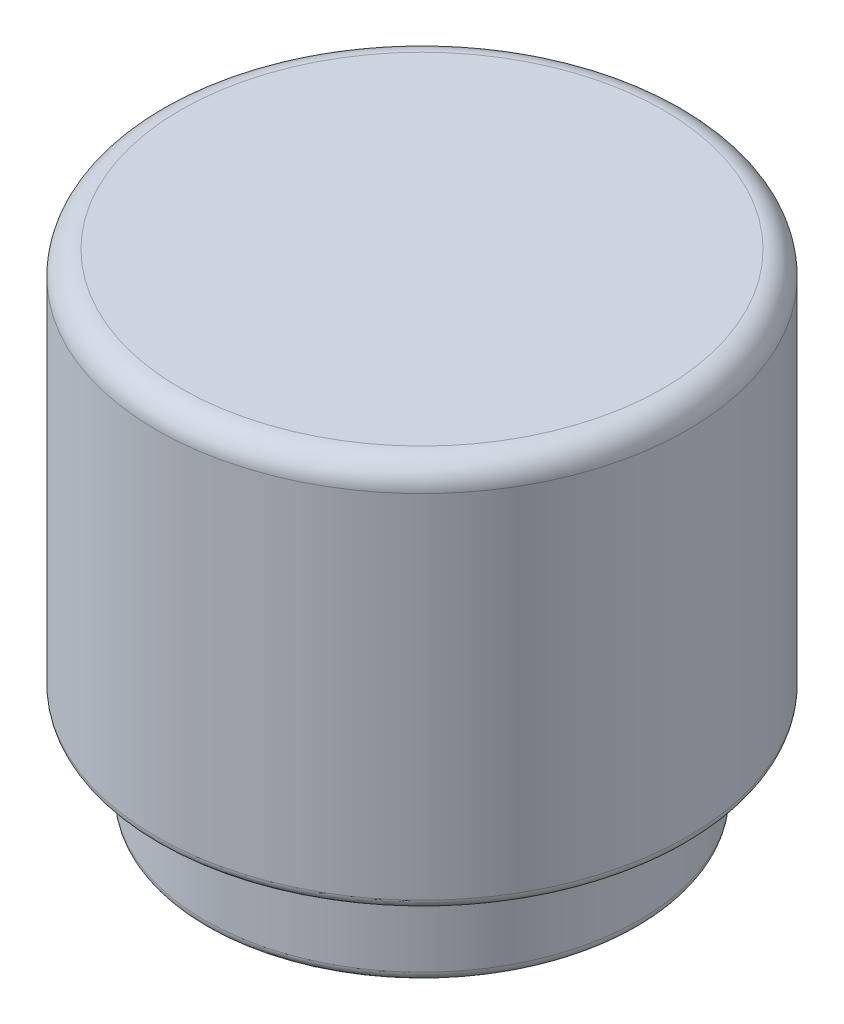
ISO-10303-21;
HEADER;
FILE_DESCRIPTION(('STEP AP214'),'2;1');
FILE_NAME('part.step','',(''),(''),'','','');
FILE_SCHEMA(('AUTOMOTIVE_DESIGN { 1 0 10303 214 1 1 1 1 }'));
ENDSEC;
DATA;
#1=APPLICATION_CONTEXT('core data for automotive mechanical design processes');
#2=APPLICATION_PROTOCOL_DEFINITION('international standard','automotive_design',2000,#1);
#3=PRODUCT_CONTEXT('',#1,'mechanical');
#4=PRODUCT('Part','Part','',(#3));
#5=PRODUCT_RELATED_PRODUCT_CATEGORY('part','',(#4));
#6=PRODUCT_DEFINITION_FORMATION('','',#4);
#7=PRODUCT_DEFINITION_CONTEXT('part definition',#1,'design');
#8=PRODUCT_DEFINITION('design','',#6,#7);
#9=PRODUCT_DEFINITION_SHAPE('','',#8);
#10=(LENGTH_UNIT() NAMED_UNIT(*) SI_UNIT(.MILLI.,.METRE.));
#11=(NAMED_UNIT(*) PLANE_ANGLE_UNIT() SI_UNIT($,.RADIAN.));
#12=(NAMED_UNIT(*) SI_UNIT($,.STERADIAN.) SOLID_ANGLE_UNIT());
#13=UNCERTAINTY_MEASURE_WITH_UNIT(LENGTH_MEASURE(1.E-05),#10,'distance_accuracy_value','');
#14=(GEOMETRIC_REPRESENTATION_CONTEXT(3) GLOBAL_UNCERTAINTY_ASSIGNED_CONTEXT((#13)) GLOBAL_UNIT_ASSIGNED_CONTEXT((#10,
#11,#12)) REPRESENTATION_CONTEXT('',''));
#15=CARTESIAN_POINT('',(0.,0.,0.));
#16=DIRECTION('',(0.,0.,1.));
#17=DIRECTION('',(1.,0.,0.));
#18=AXIS2_PLACEMENT_3D('',#15,#16,#17);
#19=CARTESIAN_POINT('',(0.,-0.5,0.));
#20=DIRECTION('',(0.,-1.,0.));
#21=DIRECTION('',(0.,0.,-1.));
#22=AXIS2_PLACEMENT_3D('',#19,#20,#21);
#23=PLANE('',#22);
#24=CARTESIAN_POINT('',(0.,-0.5,0.));
#25=DIRECTION('',(0.,-1.,0.));
#26=DIRECTION('',(0.,0.,-1.));
#27=AXIS2_PLACEMENT_3D('',#24,#25,#26);
#28=CIRCLE('',#27,4.8);
#29=CARTESIAN_POINT('',(0.,-0.499999999999999,-4.8));
#30=VERTEX_POINT('',#29);
#31=EDGE_CURVE('E66',#30,#30,#28,.T.);
#32=ORIENTED_EDGE('',*,*,#31,.T.);
#33=EDGE_LOOP('',(#32));
#34=FACE_BOUND('',#33,.T.);
#35=ADVANCED_FACE('F34',(#34),#23,.T.);
#36=CARTESIAN_POINT('',(0.,0.,0.));
#37=DIRECTION('',(0.,1.,0.));
#38=DIRECTION('',(0.,0.,1.));
#39=AXIS2_PLACEMENT_3D('',#36,#37,#38);
#40=CYLINDRICAL_SURFACE('',#39,5.);
#41=CARTESIAN_POINT('',(0.,-0.7,0.));
#42=DIRECTION('',(0.,-1.,0.));
#43=DIRECTION('',(0.,0.,-1.));
#44=AXIS2_PLACEMENT_3D('',#41,#42,#43);
#45=CIRCLE('',#44,5.);
#46=CARTESIAN_POINT('',(0.,-0.699999999999999,-5.));
#47=VERTEX_POINT('',#46);
#48=EDGE_CURVE('E69',#47,#47,#45,.F.);
#49=ORIENTED_EDGE('',*,*,#48,.T.);
#50=EDGE_LOOP('',(#49));
#51=FACE_BOUND('',#50,.T.);
#52=CARTESIAN_POINT('',(0.,-7.5,0.));
#53=DIRECTION('',(0.,1.,0.));
#54=DIRECTION('',(0.,0.,1.));
#55=AXIS2_PLACEMENT_3D('',#52,#53,#54);
#56=CIRCLE('',#55,5.);
#57=CARTESIAN_POINT('',(0.,-7.5,5.));
#58=VERTEX_POINT('',#57);
#59=EDGE_CURVE('E78',#58,#58,#56,.T.);
#60=ORIENTED_EDGE('',*,*,#59,.F.);
#61=EDGE_LOOP('',(#60));
#62=FACE_BOUND('',#61,.T.);
#63=ADVANCED_FACE('F102',(#51,#62),#40,.F.);
#64=CARTESIAN_POINT('',(0.,-7.5,4.));
#65=DIRECTION('',(0.,1.,0.));
#66=DIRECTION('',(0.,0.,1.));
#67=AXIS2_PLACEMENT_3D('',#64,#65,#66);
#68=PLANE('',#67);
#69=CARTESIAN_POINT('',(0.,-7.5,0.));
#70=DIRECTION('',(0.,1.,0.));
#71=DIRECTION('',(0.,0.,1.));
#72=AXIS2_PLACEMENT_3D('',#69,#70,#71);
#73=CIRCLE('',#72,4.2);
#74=CARTESIAN_POINT('',(0.,-7.5,4.2));
#75=VERTEX_POINT('',#74);
#76=EDGE_CURVE('E57',#75,#75,#73,.F.);
#77=ORIENTED_EDGE('',*,*,#76,.T.);
#78=EDGE_LOOP('',(#77));
#79=FACE_BOUND('',#78,.T.);
#80=ORIENTED_EDGE('',*,*,#59,.T.);
#81=EDGE_LOOP('',(#80));
#82=FACE_BOUND('',#81,.T.);
#83=ADVANCED_FACE('F108',(#79,#82),#68,.T.);
#84=CARTESIAN_POINT('',(0.,0.,0.));
#85=DIRECTION('',(0.,1.,0.));
#86=DIRECTION('',(0.,0.,1.));
#87=AXIS2_PLACEMENT_3D('',#84,#85,#86);
#88=CYLINDRICAL_SURFACE('',#87,4.);
#89=CARTESIAN_POINT('',(0.,-7.7,0.));
#90=DIRECTION('',(0.,1.,0.));
#91=DIRECTION('',(0.,0.,1.));
#92=AXIS2_PLACEMENT_3D('',#89,#90,#91);
#93=CIRCLE('',#92,4.);
#94=CARTESIAN_POINT('',(0.,-7.7,4.));
#95=VERTEX_POINT('',#94);
#96=EDGE_CURVE('E60',#95,#95,#93,.T.);
#97=ORIENTED_EDGE('',*,*,#96,.T.);
#98=EDGE_LOOP('',(#97));
#99=FACE_BOUND('',#98,.T.);
#100=CARTESIAN_POINT('',(0.,-9.8,0.));
#101=DIRECTION('',(0.,-1.,0.));
#102=DIRECTION('',(0.,0.,-1.));
#103=AXIS2_PLACEMENT_3D('',#100,#101,#102);
#104=CIRCLE('',#103,4.);
#105=CARTESIAN_POINT('',(0.,-9.8,-4.));
#106=VERTEX_POINT('',#105);
#107=EDGE_CURVE('E63',#106,#106,#104,.T.);
#108=ORIENTED_EDGE('',*,*,#107,.T.);
#109=EDGE_LOOP('',(#108));
#110=FACE_BOUND('',#109,.T.);
#111=ADVANCED_FACE('F98',(#99,#110),#88,.F.);
#112=CARTESIAN_POINT('',(0.,-10.,4.));
#113=DIRECTION('',(0.,-1.,0.));
#114=DIRECTION('',(0.,0.,-1.));
#115=AXIS2_PLACEMENT_3D('',#112,#113,#114);
#116=PLANE('',#115);
#117=CARTESIAN_POINT('',(0.,-10.,0.));
#118=DIRECTION('',(0.,-1.,0.));
#119=DIRECTION('',(0.,0.,-1.));
#120=AXIS2_PLACEMENT_3D('',#117,#118,#119);
#121=CIRCLE('',#120,4.2);
#122=CARTESIAN_POINT('',(0.,-10.,-4.2));
#123=VERTEX_POINT('',#122);
#124=EDGE_CURVE('E49',#123,#123,#121,.F.);
#125=ORIENTED_EDGE('',*,*,#124,.T.);
#126=EDGE_LOOP('',(#125));
#127=FACE_BOUND('',#126,.T.);
#128=CARTESIAN_POINT('',(0.,-10.,0.));
#129=DIRECTION('',(0.,-1.,0.));
#130=DIRECTION('',(0.,0.,-1.));
#131=AXIS2_PLACEMENT_3D('',#128,#129,#130);
#132=CIRCLE('',#131,4.3);
#133=CARTESIAN_POINT('',(0.,-10.,-4.3));
#134=VERTEX_POINT('',#133);
#135=EDGE_CURVE('E54',#134,#134,#132,.T.);
#136=ORIENTED_EDGE('',*,*,#135,.T.);
#137=EDGE_LOOP('',(#136));
#138=FACE_BOUND('',#137,.T.);
#139=ADVANCED_FACE('F89',(#127,#138),#116,.T.);
#140=CARTESIAN_POINT('',(0.,0.,0.));
#141=DIRECTION('',(0.,1.,0.));
#142=DIRECTION('',(0.,0.,1.));
#143=AXIS2_PLACEMENT_3D('',#140,#141,#142);
#144=CYLINDRICAL_SURFACE('',#143,4.5);
#145=CARTESIAN_POINT('',(0.,-9.8,0.));
#146=DIRECTION('',(0.,-1.,0.));
#147=DIRECTION('',(0.,0.,-1.));
#148=AXIS2_PLACEMENT_3D('',#145,#146,#147);
#149=CIRCLE('',#148,4.5);
#150=CARTESIAN_POINT('',(0.,-9.8,-4.5));
#151=VERTEX_POINT('',#150);
#152=EDGE_CURVE('E45',#151,#151,#149,.F.);
#153=ORIENTED_EDGE('',*,*,#152,.T.);
#154=EDGE_LOOP('',(#153));
#155=FACE_BOUND('',#154,.T.);
#156=CARTESIAN_POINT('',(0.,-8.,0.));
#157=DIRECTION('',(0.,1.,0.));
#158=DIRECTION('',(0.,0.,1.));
#159=AXIS2_PLACEMENT_3D('',#156,#157,#158);
#160=CIRCLE('',#159,4.5);
#161=CARTESIAN_POINT('',(0.,-8.,4.5));
#162=VERTEX_POINT('',#161);
#163=EDGE_CURVE('E81',#162,#162,#160,.T.);
#164=ORIENTED_EDGE('',*,*,#163,.F.);
#165=EDGE_LOOP('',(#164));
#166=FACE_BOUND('',#165,.T.);
#167=ADVANCED_FACE('F87',(#155,#166),#144,.T.);
#168=CARTESIAN_POINT('',(0.,-8.,4.5));
#169=DIRECTION('',(0.,-1.,0.));
#170=DIRECTION('',(0.,0.,-1.));
#171=AXIS2_PLACEMENT_3D('',#168,#169,#170);
#172=PLANE('',#171);
#173=CARTESIAN_POINT('',(0.,-8.,0.));
#174=DIRECTION('',(0.,-1.,0.));
#175=DIRECTION('',(0.,0.,-1.));
#176=AXIS2_PLACEMENT_3D('',#173,#174,#175);
#177=CIRCLE('',#176,5.3);
#178=CARTESIAN_POINT('',(0.,-8.,-5.3));
#179=VERTEX_POINT('',#178);
#180=EDGE_CURVE('E10',#179,#179,#177,.T.);
#181=ORIENTED_EDGE('',*,*,#180,.T.);
#182=EDGE_LOOP('',(#181));
#183=FACE_BOUND('',#182,.T.);
#184=ORIENTED_EDGE('',*,*,#163,.T.);
#185=EDGE_LOOP('',(#184));
#186=FACE_BOUND('',#185,.T.);
#187=ADVANCED_FACE('F85',(#183,#186),#172,.T.);
#188=CARTESIAN_POINT('',(0.,0.,0.));
#189=DIRECTION('',(0.,1.,0.));
#190=DIRECTION('',(0.,0.,1.));
#191=AXIS2_PLACEMENT_3D('',#188,#189,#190);
#192=CYLINDRICAL_SURFACE('',#191,5.5);
#193=CARTESIAN_POINT('',(0.,-7.8,0.));
#194=DIRECTION('',(0.,-1.,0.));
#195=DIRECTION('',(0.,0.,-1.));
#196=AXIS2_PLACEMENT_3D('',#193,#194,#195);
#197=CIRCLE('',#196,5.5);
#198=CARTESIAN_POINT('',(0.,-7.8,-5.5));
#199=VERTEX_POINT('',#198);
#200=EDGE_CURVE('E41',#199,#199,#197,.F.);
#201=ORIENTED_EDGE('',*,*,#200,.T.);
#202=EDGE_LOOP('',(#201));
#203=FACE_BOUND('',#202,.T.);
#204=CARTESIAN_POINT('',(0.,-0.5,0.));
#205=DIRECTION('',(0.,1.,0.));
#206=DIRECTION('',(0.,0.,1.));
#207=AXIS2_PLACEMENT_3D('',#204,#205,#206);
#208=CIRCLE('',#207,5.5);
#209=CARTESIAN_POINT('',(0.,-0.500000000000001,5.5));
#210=VERTEX_POINT('',#209);
#211=EDGE_CURVE('E72',#210,#210,#208,.F.);
#212=ORIENTED_EDGE('',*,*,#211,.T.);
#213=EDGE_LOOP('',(#212));
#214=FACE_BOUND('',#213,.T.);
#215=ADVANCED_FACE('F96',(#203,#214),#192,.T.);
#216=CARTESIAN_POINT('',(0.,0.,0.));
#217=DIRECTION('',(0.,1.,0.));
#218=DIRECTION('',(0.,0.,1.));
#219=AXIS2_PLACEMENT_3D('',#216,#217,#218);
#220=PLANE('',#219);
#221=CARTESIAN_POINT('',(0.,0.,0.));
#222=DIRECTION('',(0.,1.,0.));
#223=DIRECTION('',(0.,0.,1.));
#224=AXIS2_PLACEMENT_3D('',#221,#222,#223);
#225=CIRCLE('',#224,5.);
#226=CARTESIAN_POINT('',(0.,0.,5.));
#227=VERTEX_POINT('',#226);
#228=EDGE_CURVE('E75',#227,#227,#225,.T.);
#229=ORIENTED_EDGE('',*,*,#228,.T.);
#230=EDGE_LOOP('',(#229));
#231=FACE_BOUND('',#230,.T.);
#232=ADVANCED_FACE('F117',(#231),#220,.T.);
#233=CARTESIAN_POINT('',(0.,-0.5,0.));
#234=DIRECTION('',(0.,1.,0.));
#235=DIRECTION('',(0.,0.,1.));
#236=AXIS2_PLACEMENT_3D('',#233,#234,#235);
#237=TOROIDAL_SURFACE('',#236,5.,0.5);
#238=ORIENTED_EDGE('',*,*,#211,.F.);
#239=EDGE_LOOP('',(#238));
#240=FACE_BOUND('',#239,.T.);
#241=ORIENTED_EDGE('',*,*,#228,.F.);
#242=EDGE_LOOP('',(#241));
#243=FACE_BOUND('',#242,.T.);
#244=ADVANCED_FACE('F113',(#240,#243),#237,.T.);
#245=CARTESIAN_POINT('',(0.,-0.7,0.));
#246=DIRECTION('',(0.,-1.,0.));
#247=DIRECTION('',(0.,0.,-1.));
#248=AXIS2_PLACEMENT_3D('',#245,#246,#247);
#249=TOROIDAL_SURFACE('',#248,4.8,0.2);
#250=ORIENTED_EDGE('',*,*,#31,.F.);
#251=EDGE_LOOP('',(#250));
#252=FACE_BOUND('',#251,.T.);
#253=ORIENTED_EDGE('',*,*,#48,.F.);
#254=EDGE_LOOP('',(#253));
#255=FACE_BOUND('',#254,.T.);
#256=ADVANCED_FACE('F116',(#252,#255),#249,.F.);
#257=CARTESIAN_POINT('',(0.,-7.7,0.));
#258=DIRECTION('',(0.,1.,0.));
#259=DIRECTION('',(0.,0.,1.));
#260=AXIS2_PLACEMENT_3D('',#257,#258,#259);
#261=TOROIDAL_SURFACE('',#260,4.2,0.2);
#262=ORIENTED_EDGE('',*,*,#76,.F.);
#263=EDGE_LOOP('',(#262));
#264=FACE_BOUND('',#263,.T.);
#265=ORIENTED_EDGE('',*,*,#96,.F.);
#266=EDGE_LOOP('',(#265));
#267=FACE_BOUND('',#266,.T.);
#268=ADVANCED_FACE('F121',(#264,#267),#261,.T.);
#269=CARTESIAN_POINT('',(0.,-9.8,0.));
#270=DIRECTION('',(0.,-1.,0.));
#271=DIRECTION('',(0.,0.,-1.));
#272=AXIS2_PLACEMENT_3D('',#269,#270,#271);
#273=TOROIDAL_SURFACE('',#272,4.2,0.2);
#274=ORIENTED_EDGE('',*,*,#107,.F.);
#275=EDGE_LOOP('',(#274));
#276=FACE_BOUND('',#275,.T.);
#277=ORIENTED_EDGE('',*,*,#124,.F.);
#278=EDGE_LOOP('',(#277));
#279=FACE_BOUND('',#278,.T.);
#280=ADVANCED_FACE('F125',(#276,#279),#273,.T.);
#281=CARTESIAN_POINT('',(0.,-9.8,0.));
#282=DIRECTION('',(0.,-1.,0.));
#283=DIRECTION('',(0.,0.,-1.));
#284=AXIS2_PLACEMENT_3D('',#281,#282,#283);
#285=TOROIDAL_SURFACE('',#284,4.3,0.2);
#286=ORIENTED_EDGE('',*,*,#135,.F.);
#287=EDGE_LOOP('',(#286));
#288=FACE_BOUND('',#287,.T.);
#289=ORIENTED_EDGE('',*,*,#152,.F.);
#290=EDGE_LOOP('',(#289));
#291=FACE_BOUND('',#290,.T.);
#292=ADVANCED_FACE('F128',(#288,#291),#285,.T.);
#293=CARTESIAN_POINT('',(0.,-7.8,0.));
#294=DIRECTION('',(0.,-1.,0.));
#295=DIRECTION('',(0.,0.,-1.));
#296=AXIS2_PLACEMENT_3D('',#293,#294,#295);
#297=TOROIDAL_SURFACE('',#296,5.3,0.2);
#298=ORIENTED_EDGE('',*,*,#180,.F.);
#299=EDGE_LOOP('',(#298));
#300=FACE_BOUND('',#299,.T.);
#301=ORIENTED_EDGE('',*,*,#200,.F.);
#302=EDGE_LOOP('',(#301));
#303=FACE_BOUND('',#302,.T.);
#304=ADVANCED_FACE('F36',(#300,#303),#297,.T.);
#305=CLOSED_SHELL('',(#35,#63,#83,#111,#139,#167,#187,#215,#232,#244,#256,#268,#280,#292,#304));
#306=MANIFOLD_SOLID_BREP('B2',#305);
#307=ADVANCED_BREP_SHAPE_REPRESENTATION('',(#18,#306),#14);
#308=SHAPE_DEFINITION_REPRESENTATION(#9,#307);
ENDSEC;
END-ISO-10303-21;
